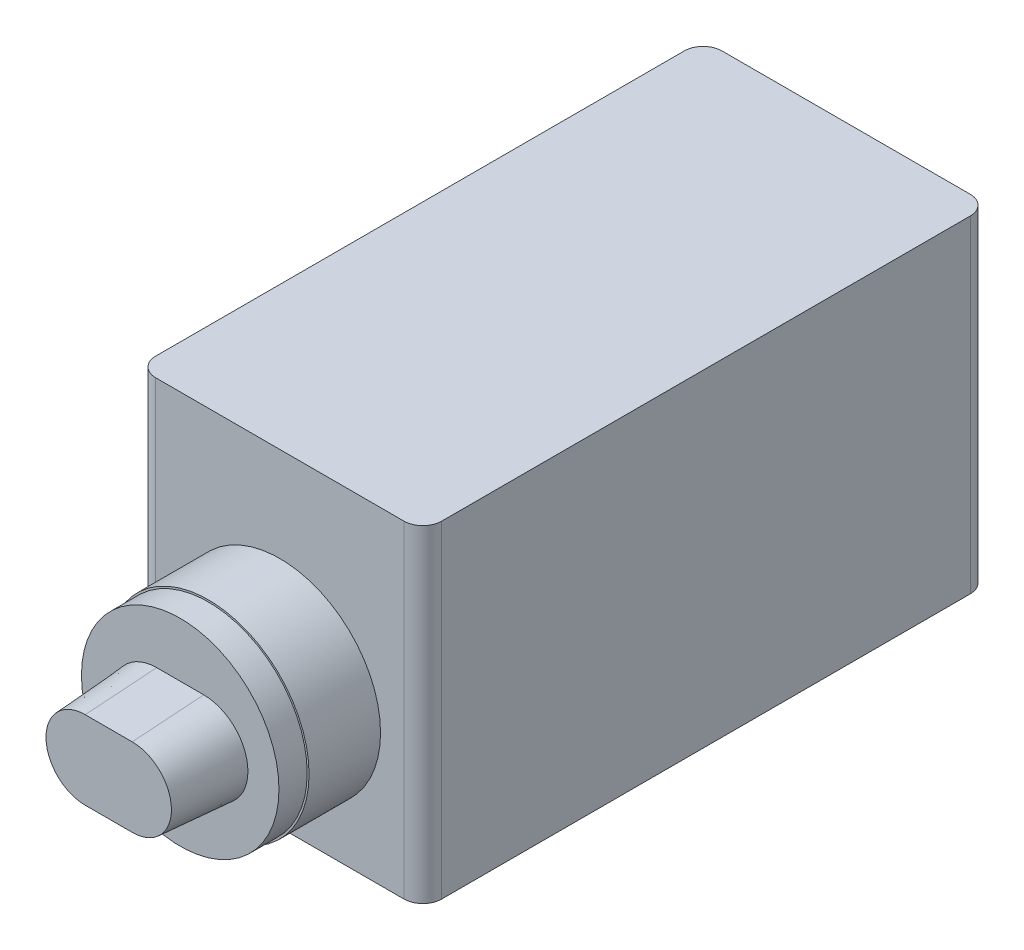
ISO-10303-21;
HEADER;
FILE_DESCRIPTION(('STEP AP214'),'2;1');
FILE_NAME('part.step','',(''),(''),'','','');
FILE_SCHEMA(('AUTOMOTIVE_DESIGN { 1 0 10303 214 1 1 1 1 }'));
ENDSEC;
DATA;
#1=APPLICATION_CONTEXT('core data for automotive mechanical design processes');
#2=APPLICATION_PROTOCOL_DEFINITION('international standard','automotive_design',2000,#1);
#3=PRODUCT_CONTEXT('',#1,'mechanical');
#4=PRODUCT('Part','Part','',(#3));
#5=PRODUCT_RELATED_PRODUCT_CATEGORY('part','',(#4));
#6=PRODUCT_DEFINITION_FORMATION('','',#4);
#7=PRODUCT_DEFINITION_CONTEXT('part definition',#1,'design');
#8=PRODUCT_DEFINITION('design','',#6,#7);
#9=PRODUCT_DEFINITION_SHAPE('','',#8);
#10=(LENGTH_UNIT() NAMED_UNIT(*) SI_UNIT(.MILLI.,.METRE.));
#11=(NAMED_UNIT(*) PLANE_ANGLE_UNIT() SI_UNIT($,.RADIAN.));
#12=(NAMED_UNIT(*) SI_UNIT($,.STERADIAN.) SOLID_ANGLE_UNIT());
#13=UNCERTAINTY_MEASURE_WITH_UNIT(LENGTH_MEASURE(1.E-05),#10,'distance_accuracy_value','');
#14=(GEOMETRIC_REPRESENTATION_CONTEXT(3) GLOBAL_UNCERTAINTY_ASSIGNED_CONTEXT((#13)) GLOBAL_UNIT_ASSIGNED_CONTEXT((#10,
#11,#12)) REPRESENTATION_CONTEXT('',''));
#15=CARTESIAN_POINT('',(0.,0.,0.));
#16=DIRECTION('',(0.,0.,1.));
#17=DIRECTION('',(1.,0.,0.));
#18=AXIS2_PLACEMENT_3D('',#15,#16,#17);
#19=CARTESIAN_POINT('',(0.,7.03074551830696,20.35));
#20=DIRECTION('',(0.,0.,1.));
#21=DIRECTION('',(1.,0.,0.));
#22=AXIS2_PLACEMENT_3D('',#19,#20,#21);
#23=PLANE('',#22);
#24=CARTESIAN_POINT('',(0.,7.03074551830696,20.35));
#25=DIRECTION('',(0.,0.,1.));
#26=DIRECTION('',(1.,0.,0.));
#27=AXIS2_PLACEMENT_3D('',#24,#25,#26);
#28=CIRCLE('',#27,5.25);
#29=CARTESIAN_POINT('',(5.25,7.03074551830696,20.35));
#30=VERTEX_POINT('',#29);
#31=EDGE_CURVE('E168',#30,#30,#28,.T.);
#32=ORIENTED_EDGE('',*,*,#31,.T.);
#33=EDGE_LOOP('',(#32));
#34=FACE_BOUND('',#33,.T.);
#35=DIRECTION('',(1.,0.,0.));
#36=VECTOR('',#35,1.);
#37=CARTESIAN_POINT('',(-1.25,4.68074551830696,20.35));
#38=LINE('',#37,#36);
#39=CARTESIAN_POINT('',(-1.25,4.68074551830696,20.35));
#40=VERTEX_POINT('',#39);
#41=CARTESIAN_POINT('',(1.25,4.68074551830696,20.35));
#42=VERTEX_POINT('',#41);
#43=EDGE_CURVE('E133',#40,#42,#38,.T.);
#44=ORIENTED_EDGE('',*,*,#43,.F.);
#45=CARTESIAN_POINT('',(-1.25,7.03074551830696,20.35));
#46=DIRECTION('',(0.,0.,1.));
#47=DIRECTION('',(1.,0.,0.));
#48=AXIS2_PLACEMENT_3D('',#45,#46,#47);
#49=CIRCLE('',#48,2.35);
#50=CARTESIAN_POINT('',(-1.25,9.38074551830696,20.35));
#51=VERTEX_POINT('',#50);
#52=EDGE_CURVE('E144',#51,#40,#49,.T.);
#53=ORIENTED_EDGE('',*,*,#52,.F.);
#54=DIRECTION('',(-1.,0.,0.));
#55=VECTOR('',#54,1.);
#56=CARTESIAN_POINT('',(-1.25,9.38074551830696,20.35));
#57=LINE('',#56,#55);
#58=CARTESIAN_POINT('',(1.25,9.38074551830696,20.35));
#59=VERTEX_POINT('',#58);
#60=EDGE_CURVE('E154',#59,#51,#57,.T.);
#61=ORIENTED_EDGE('',*,*,#60,.F.);
#62=CARTESIAN_POINT('',(1.25,7.03074551830696,20.35));
#63=DIRECTION('',(0.,0.,1.));
#64=DIRECTION('',(1.,0.,0.));
#65=AXIS2_PLACEMENT_3D('',#62,#63,#64);
#66=CIRCLE('',#65,2.35);
#67=EDGE_CURVE('E152',#42,#59,#66,.T.);
#68=ORIENTED_EDGE('',*,*,#67,.F.);
#69=EDGE_LOOP('',(#44,#53,#61,#68));
#70=FACE_BOUND('',#69,.T.);
#71=ADVANCED_FACE('F37',(#34,#70),#23,.T.);
#72=CARTESIAN_POINT('',(0.,7.03074551830696,18.85));
#73=DIRECTION('',(0.,0.,1.));
#74=DIRECTION('',(1.,0.,0.));
#75=AXIS2_PLACEMENT_3D('',#72,#73,#74);
#76=PLANE('',#75);
#77=CARTESIAN_POINT('',(0.,7.03074551830696,18.85));
#78=DIRECTION('',(0.,0.,1.));
#79=DIRECTION('',(1.,0.,0.));
#80=AXIS2_PLACEMENT_3D('',#77,#78,#79);
#81=CIRCLE('',#80,5.35);
#82=CARTESIAN_POINT('',(5.35,7.03074551830696,18.85));
#83=VERTEX_POINT('',#82);
#84=EDGE_CURVE('E171',#83,#83,#81,.T.);
#85=ORIENTED_EDGE('',*,*,#84,.T.);
#86=EDGE_LOOP('',(#85));
#87=FACE_BOUND('',#86,.T.);
#88=CARTESIAN_POINT('',(0.,7.03074551830696,18.85));
#89=DIRECTION('',(0.,0.,1.));
#90=DIRECTION('',(1.,0.,0.));
#91=AXIS2_PLACEMENT_3D('',#88,#89,#90);
#92=CIRCLE('',#91,5.25);
#93=CARTESIAN_POINT('',(5.25,7.03074551830696,18.85));
#94=VERTEX_POINT('',#93);
#95=EDGE_CURVE('E139',#94,#94,#92,.T.);
#96=ORIENTED_EDGE('',*,*,#95,.F.);
#97=EDGE_LOOP('',(#96));
#98=FACE_BOUND('',#97,.T.);
#99=ADVANCED_FACE('F275',(#87,#98),#76,.T.);
#100=CARTESIAN_POINT('',(7.6,17.4,15.05));
#101=DIRECTION('',(0.,0.,-1.));
#102=DIRECTION('',(-1.,0.,0.));
#103=AXIS2_PLACEMENT_3D('',#100,#101,#102);
#104=PLANE('',#103);
#105=DIRECTION('',(1.,0.,0.));
#106=VECTOR('',#105,1.);
#107=CARTESIAN_POINT('',(7.6,17.4,15.05));
#108=LINE('',#107,#106);
#109=CARTESIAN_POINT('',(-6.6,17.4,15.05));
#110=VERTEX_POINT('',#109);
#111=CARTESIAN_POINT('',(6.6,17.4,15.05));
#112=VERTEX_POINT('',#111);
#113=EDGE_CURVE('E180',#110,#112,#108,.T.);
#114=ORIENTED_EDGE('',*,*,#113,.F.);
#115=DIRECTION('',(0.,-1.,0.));
#116=VECTOR('',#115,1.);
#117=CARTESIAN_POINT('',(-6.6,17.4,15.05));
#118=LINE('',#117,#116);
#119=CARTESIAN_POINT('',(-6.6,0.,15.05));
#120=VERTEX_POINT('',#119);
#121=EDGE_CURVE('E45',#110,#120,#118,.T.);
#122=ORIENTED_EDGE('',*,*,#121,.T.);
#123=DIRECTION('',(1.,0.,0.));
#124=VECTOR('',#123,1.);
#125=CARTESIAN_POINT('',(7.6,0.,15.05));
#126=LINE('',#125,#124);
#127=CARTESIAN_POINT('',(6.6,0.,15.05));
#128=VERTEX_POINT('',#127);
#129=EDGE_CURVE('E192',#120,#128,#126,.T.);
#130=ORIENTED_EDGE('',*,*,#129,.T.);
#131=DIRECTION('',(0.,-1.,0.));
#132=VECTOR('',#131,1.);
#133=CARTESIAN_POINT('',(6.6,17.4,15.05));
#134=LINE('',#133,#132);
#135=EDGE_CURVE('E228',#128,#112,#134,.F.);
#136=ORIENTED_EDGE('',*,*,#135,.T.);
#137=EDGE_LOOP('',(#114,#122,#130,#136));
#138=FACE_BOUND('',#137,.T.);
#139=CARTESIAN_POINT('',(0.,7.03074551830696,15.05));
#140=DIRECTION('',(0.,0.,-1.));
#141=DIRECTION('',(-1.,0.,0.));
#142=AXIS2_PLACEMENT_3D('',#139,#140,#141);
#143=CIRCLE('',#142,5.35);
#144=CARTESIAN_POINT('',(-5.35,7.03074551830696,15.05));
#145=VERTEX_POINT('',#144);
#146=EDGE_CURVE('E11',#145,#145,#143,.F.);
#147=ORIENTED_EDGE('',*,*,#146,.F.);
#148=EDGE_LOOP('',(#147));
#149=FACE_BOUND('',#148,.T.);
#150=ADVANCED_FACE('F234',(#138,#149),#104,.F.);
#151=CARTESIAN_POINT('',(-7.6,17.4,15.05));
#152=DIRECTION('',(1.,0.,0.));
#153=DIRECTION('',(0.,0.,-1.));
#154=AXIS2_PLACEMENT_3D('',#151,#152,#153);
#155=PLANE('',#154);
#156=DIRECTION('',(0.,0.,1.));
#157=VECTOR('',#156,1.);
#158=CARTESIAN_POINT('',(-7.6,17.4,15.05));
#159=LINE('',#158,#157);
#160=CARTESIAN_POINT('',(-7.6,17.4,-14.05));
#161=VERTEX_POINT('',#160);
#162=CARTESIAN_POINT('',(-7.6,17.4,14.05));
#163=VERTEX_POINT('',#162);
#164=EDGE_CURVE('E177',#161,#163,#159,.T.);
#165=ORIENTED_EDGE('',*,*,#164,.F.);
#166=DIRECTION('',(0.,-1.,0.));
#167=VECTOR('',#166,1.);
#168=CARTESIAN_POINT('',(-7.6,17.4,-14.05));
#169=LINE('',#168,#167);
#170=CARTESIAN_POINT('',(-7.6,0.,-14.05));
#171=VERTEX_POINT('',#170);
#172=EDGE_CURVE('E200',#161,#171,#169,.T.);
#173=ORIENTED_EDGE('',*,*,#172,.T.);
#174=DIRECTION('',(0.,0.,1.));
#175=VECTOR('',#174,1.);
#176=CARTESIAN_POINT('',(-7.6,0.,15.05));
#177=LINE('',#176,#175);
#178=CARTESIAN_POINT('',(-7.6,0.,14.05));
#179=VERTEX_POINT('',#178);
#180=EDGE_CURVE('E176',#171,#179,#177,.T.);
#181=ORIENTED_EDGE('',*,*,#180,.T.);
#182=DIRECTION('',(0.,-1.,0.));
#183=VECTOR('',#182,1.);
#184=CARTESIAN_POINT('',(-7.6,17.4,14.05));
#185=LINE('',#184,#183);
#186=EDGE_CURVE('E189',#179,#163,#185,.F.);
#187=ORIENTED_EDGE('',*,*,#186,.T.);
#188=EDGE_LOOP('',(#165,#173,#181,#187));
#189=FACE_BOUND('',#188,.T.);
#190=ADVANCED_FACE('F264',(#189),#155,.F.);
#191=CARTESIAN_POINT('',(7.6,17.4,15.05));
#192=DIRECTION('',(-1.,0.,0.));
#193=DIRECTION('',(0.,0.,1.));
#194=AXIS2_PLACEMENT_3D('',#191,#192,#193);
#195=PLANE('',#194);
#196=DIRECTION('',(0.,0.,-1.));
#197=VECTOR('',#196,1.);
#198=CARTESIAN_POINT('',(7.6,0.,15.05));
#199=LINE('',#198,#197);
#200=CARTESIAN_POINT('',(7.6,0.,14.05));
#201=VERTEX_POINT('',#200);
#202=CARTESIAN_POINT('',(7.6,0.,-14.05));
#203=VERTEX_POINT('',#202);
#204=EDGE_CURVE('E195',#201,#203,#199,.T.);
#205=ORIENTED_EDGE('',*,*,#204,.T.);
#206=DIRECTION('',(0.,-1.,0.));
#207=VECTOR('',#206,1.);
#208=CARTESIAN_POINT('',(7.6,17.4,-14.05));
#209=LINE('',#208,#207);
#210=CARTESIAN_POINT('',(7.6,17.4,-14.05));
#211=VERTEX_POINT('',#210);
#212=EDGE_CURVE('E60',#203,#211,#209,.F.);
#213=ORIENTED_EDGE('',*,*,#212,.T.);
#214=DIRECTION('',(0.,0.,-1.));
#215=VECTOR('',#214,1.);
#216=CARTESIAN_POINT('',(7.6,17.4,15.05));
#217=LINE('',#216,#215);
#218=CARTESIAN_POINT('',(7.6,17.4,14.05));
#219=VERTEX_POINT('',#218);
#220=EDGE_CURVE('E184',#219,#211,#217,.T.);
#221=ORIENTED_EDGE('',*,*,#220,.F.);
#222=DIRECTION('',(0.,-1.,0.));
#223=VECTOR('',#222,1.);
#224=CARTESIAN_POINT('',(7.6,17.4,14.05));
#225=LINE('',#224,#223);
#226=EDGE_CURVE('E224',#219,#201,#225,.T.);
#227=ORIENTED_EDGE('',*,*,#226,.T.);
#228=EDGE_LOOP('',(#205,#213,#221,#227));
#229=FACE_BOUND('',#228,.T.);
#230=ADVANCED_FACE('F246',(#229),#195,.F.);
#231=CARTESIAN_POINT('',(7.6,17.4,-15.05));
#232=DIRECTION('',(0.,0.,1.));
#233=DIRECTION('',(1.,0.,0.));
#234=AXIS2_PLACEMENT_3D('',#231,#232,#233);
#235=PLANE('',#234);
#236=DIRECTION('',(-1.,0.,0.));
#237=VECTOR('',#236,1.);
#238=CARTESIAN_POINT('',(7.6,0.,-15.05));
#239=LINE('',#238,#237);
#240=CARTESIAN_POINT('',(6.6,0.,-15.05));
#241=VERTEX_POINT('',#240);
#242=CARTESIAN_POINT('',(-6.6,0.,-15.05));
#243=VERTEX_POINT('',#242);
#244=EDGE_CURVE('E181',#241,#243,#239,.T.);
#245=ORIENTED_EDGE('',*,*,#244,.T.);
#246=DIRECTION('',(0.,-1.,0.));
#247=VECTOR('',#246,1.);
#248=CARTESIAN_POINT('',(-6.6,17.4,-15.05));
#249=LINE('',#248,#247);
#250=CARTESIAN_POINT('',(-6.6,17.4,-15.05));
#251=VERTEX_POINT('',#250);
#252=EDGE_CURVE('E214',#243,#251,#249,.F.);
#253=ORIENTED_EDGE('',*,*,#252,.T.);
#254=DIRECTION('',(-1.,0.,0.));
#255=VECTOR('',#254,1.);
#256=CARTESIAN_POINT('',(7.6,17.4,-15.05));
#257=LINE('',#256,#255);
#258=CARTESIAN_POINT('',(6.6,17.4,-15.05));
#259=VERTEX_POINT('',#258);
#260=EDGE_CURVE('E186',#259,#251,#257,.T.);
#261=ORIENTED_EDGE('',*,*,#260,.F.);
#262=DIRECTION('',(0.,-1.,0.));
#263=VECTOR('',#262,1.);
#264=CARTESIAN_POINT('',(6.6,17.4,-15.05));
#265=LINE('',#264,#263);
#266=EDGE_CURVE('E211',#259,#241,#265,.T.);
#267=ORIENTED_EDGE('',*,*,#266,.T.);
#268=EDGE_LOOP('',(#245,#253,#261,#267));
#269=FACE_BOUND('',#268,.T.);
#270=ADVANCED_FACE('F256',(#269),#235,.F.);
#271=CARTESIAN_POINT('',(-7.6,17.4,-15.05));
#272=DIRECTION('',(0.,1.,0.));
#273=DIRECTION('',(0.,0.,1.));
#274=AXIS2_PLACEMENT_3D('',#271,#272,#273);
#275=PLANE('',#274);
#276=ORIENTED_EDGE('',*,*,#260,.T.);
#277=CARTESIAN_POINT('',(-6.6,17.4,-14.05));
#278=DIRECTION('',(0.,1.,0.));
#279=DIRECTION('',(0.,0.,1.));
#280=AXIS2_PLACEMENT_3D('',#277,#278,#279);
#281=CIRCLE('',#280,1.);
#282=EDGE_CURVE('E222',#251,#161,#281,.T.);
#283=ORIENTED_EDGE('',*,*,#282,.T.);
#284=ORIENTED_EDGE('',*,*,#164,.T.);
#285=CARTESIAN_POINT('',(-6.6,17.4,14.05));
#286=DIRECTION('',(0.,1.,0.));
#287=DIRECTION('',(0.,0.,1.));
#288=AXIS2_PLACEMENT_3D('',#285,#286,#287);
#289=CIRCLE('',#288,1.);
#290=EDGE_CURVE('E218',#163,#110,#289,.T.);
#291=ORIENTED_EDGE('',*,*,#290,.T.);
#292=ORIENTED_EDGE('',*,*,#113,.T.);
#293=CARTESIAN_POINT('',(6.6,17.4,14.05));
#294=DIRECTION('',(0.,1.,0.));
#295=DIRECTION('',(0.,0.,1.));
#296=AXIS2_PLACEMENT_3D('',#293,#294,#295);
#297=CIRCLE('',#296,1.);
#298=EDGE_CURVE('E216',#112,#219,#297,.T.);
#299=ORIENTED_EDGE('',*,*,#298,.T.);
#300=ORIENTED_EDGE('',*,*,#220,.T.);
#301=CARTESIAN_POINT('',(6.6,17.4,-14.05));
#302=DIRECTION('',(0.,1.,0.));
#303=DIRECTION('',(0.,0.,1.));
#304=AXIS2_PLACEMENT_3D('',#301,#302,#303);
#305=CIRCLE('',#304,1.);
#306=EDGE_CURVE('E220',#211,#259,#305,.T.);
#307=ORIENTED_EDGE('',*,*,#306,.T.);
#308=EDGE_LOOP('',(#276,#283,#284,#291,#292,#299,#300,#307));
#309=FACE_BOUND('',#308,.T.);
#310=ADVANCED_FACE('F249',(#309),#275,.T.);
#311=CARTESIAN_POINT('',(-7.6,0.,-15.05));
#312=DIRECTION('',(0.,1.,0.));
#313=DIRECTION('',(0.,0.,1.));
#314=AXIS2_PLACEMENT_3D('',#311,#312,#313);
#315=PLANE('',#314);
#316=ORIENTED_EDGE('',*,*,#180,.F.);
#317=CARTESIAN_POINT('',(-6.6,0.,-14.05));
#318=DIRECTION('',(0.,1.,0.));
#319=DIRECTION('',(0.,0.,1.));
#320=AXIS2_PLACEMENT_3D('',#317,#318,#319);
#321=CIRCLE('',#320,1.);
#322=EDGE_CURVE('E209',#171,#243,#321,.F.);
#323=ORIENTED_EDGE('',*,*,#322,.T.);
#324=ORIENTED_EDGE('',*,*,#244,.F.);
#325=CARTESIAN_POINT('',(6.6,0.,-14.05));
#326=DIRECTION('',(0.,1.,0.));
#327=DIRECTION('',(0.,0.,1.));
#328=AXIS2_PLACEMENT_3D('',#325,#326,#327);
#329=CIRCLE('',#328,1.);
#330=EDGE_CURVE('E207',#241,#203,#329,.F.);
#331=ORIENTED_EDGE('',*,*,#330,.T.);
#332=ORIENTED_EDGE('',*,*,#204,.F.);
#333=CARTESIAN_POINT('',(6.6,0.,14.05));
#334=DIRECTION('',(0.,1.,0.));
#335=DIRECTION('',(0.,0.,1.));
#336=AXIS2_PLACEMENT_3D('',#333,#334,#335);
#337=CIRCLE('',#336,1.);
#338=EDGE_CURVE('E203',#201,#128,#337,.F.);
#339=ORIENTED_EDGE('',*,*,#338,.T.);
#340=ORIENTED_EDGE('',*,*,#129,.F.);
#341=CARTESIAN_POINT('',(-6.6,0.,14.05));
#342=DIRECTION('',(0.,1.,0.));
#343=DIRECTION('',(0.,0.,1.));
#344=AXIS2_PLACEMENT_3D('',#341,#342,#343);
#345=CIRCLE('',#344,1.);
#346=EDGE_CURVE('E205',#120,#179,#345,.F.);
#347=ORIENTED_EDGE('',*,*,#346,.T.);
#348=EDGE_LOOP('',(#316,#323,#324,#331,#332,#339,#340,#347));
#349=FACE_BOUND('',#348,.T.);
#350=ADVANCED_FACE('F241',(#349),#315,.F.);
#351=CARTESIAN_POINT('',(-6.6,17.4,-14.05));
#352=DIRECTION('',(0.,-1.,0.));
#353=DIRECTION('',(0.,0.,-1.));
#354=AXIS2_PLACEMENT_3D('',#351,#352,#353);
#355=CYLINDRICAL_SURFACE('',#354,1.);
#356=ORIENTED_EDGE('',*,*,#282,.F.);
#357=ORIENTED_EDGE('',*,*,#252,.F.);
#358=ORIENTED_EDGE('',*,*,#322,.F.);
#359=ORIENTED_EDGE('',*,*,#172,.F.);
#360=EDGE_LOOP('',(#356,#357,#358,#359));
#361=FACE_BOUND('',#360,.T.);
#362=ADVANCED_FACE('F261',(#361),#355,.T.);
#363=CARTESIAN_POINT('',(6.6,17.4,-14.05));
#364=DIRECTION('',(0.,-1.,0.));
#365=DIRECTION('',(0.,0.,-1.));
#366=AXIS2_PLACEMENT_3D('',#363,#364,#365);
#367=CYLINDRICAL_SURFACE('',#366,1.);
#368=ORIENTED_EDGE('',*,*,#306,.F.);
#369=ORIENTED_EDGE('',*,*,#212,.F.);
#370=ORIENTED_EDGE('',*,*,#330,.F.);
#371=ORIENTED_EDGE('',*,*,#266,.F.);
#372=EDGE_LOOP('',(#368,#369,#370,#371));
#373=FACE_BOUND('',#372,.T.);
#374=ADVANCED_FACE('F253',(#373),#367,.T.);
#375=CARTESIAN_POINT('',(-6.6,17.4,14.05));
#376=DIRECTION('',(0.,-1.,0.));
#377=DIRECTION('',(0.,0.,-1.));
#378=AXIS2_PLACEMENT_3D('',#375,#376,#377);
#379=CYLINDRICAL_SURFACE('',#378,1.);
#380=ORIENTED_EDGE('',*,*,#290,.F.);
#381=ORIENTED_EDGE('',*,*,#186,.F.);
#382=ORIENTED_EDGE('',*,*,#346,.F.);
#383=ORIENTED_EDGE('',*,*,#121,.F.);
#384=EDGE_LOOP('',(#380,#381,#382,#383));
#385=FACE_BOUND('',#384,.T.);
#386=ADVANCED_FACE('F266',(#385),#379,.T.);
#387=CARTESIAN_POINT('',(6.6,17.4,14.05));
#388=DIRECTION('',(0.,-1.,0.));
#389=DIRECTION('',(0.,0.,-1.));
#390=AXIS2_PLACEMENT_3D('',#387,#388,#389);
#391=CYLINDRICAL_SURFACE('',#390,1.);
#392=ORIENTED_EDGE('',*,*,#298,.F.);
#393=ORIENTED_EDGE('',*,*,#135,.F.);
#394=ORIENTED_EDGE('',*,*,#338,.F.);
#395=ORIENTED_EDGE('',*,*,#226,.F.);
#396=EDGE_LOOP('',(#392,#393,#394,#395));
#397=FACE_BOUND('',#396,.T.);
#398=ADVANCED_FACE('F39',(#397),#391,.T.);
#399=CARTESIAN_POINT('',(0.,7.03074551830696,18.85));
#400=DIRECTION('',(0.,0.,-1.));
#401=DIRECTION('',(-1.,0.,0.));
#402=AXIS2_PLACEMENT_3D('',#399,#400,#401);
#403=CYLINDRICAL_SURFACE('',#402,5.35);
#404=ORIENTED_EDGE('',*,*,#84,.F.);
#405=EDGE_LOOP('',(#404));
#406=FACE_BOUND('',#405,.T.);
#407=ORIENTED_EDGE('',*,*,#146,.T.);
#408=EDGE_LOOP('',(#407));
#409=FACE_BOUND('',#408,.T.);
#410=ADVANCED_FACE('F272',(#406,#409),#403,.T.);
#411=CARTESIAN_POINT('',(0.,7.03074551830696,20.35));
#412=DIRECTION('',(0.,0.,-1.));
#413=DIRECTION('',(-1.,0.,0.));
#414=AXIS2_PLACEMENT_3D('',#411,#412,#413);
#415=CYLINDRICAL_SURFACE('',#414,5.25);
#416=ORIENTED_EDGE('',*,*,#31,.F.);
#417=EDGE_LOOP('',(#416));
#418=FACE_BOUND('',#417,.T.);
#419=ORIENTED_EDGE('',*,*,#95,.T.);
#420=EDGE_LOOP('',(#419));
#421=FACE_BOUND('',#420,.T.);
#422=ADVANCED_FACE('F287',(#418,#421),#415,.T.);
#423=CARTESIAN_POINT('',(-1.25,7.03074551830696,20.35));
#424=DIRECTION('',(0.,0.,-1.));
#425=DIRECTION('',(1.,0.,0.));
#426=AXIS2_PLACEMENT_3D('',#423,#424,#425);
#427=CONICAL_SURFACE('',#426,2.35,0.0698131700797733);
#428=ORIENTED_EDGE('',*,*,#52,.T.);
#429=DIRECTION('',(0.,-0.0697564737441255,-0.997564050259824));
#430=VECTOR('',#429,1.);
#431=CARTESIAN_POINT('',(-1.25,4.68074551830696,20.35));
#432=LINE('',#431,#430);
#433=CARTESIAN_POINT('',(-1.25,4.9464674036923,24.15));
#434=VERTEX_POINT('',#433);
#435=EDGE_CURVE('E128',#434,#40,#432,.T.);
#436=ORIENTED_EDGE('',*,*,#435,.F.);
#437=CARTESIAN_POINT('',(-1.25,7.03074551830696,24.15));
#438=DIRECTION('',(0.,0.,1.));
#439=DIRECTION('',(1.,0.,0.));
#440=AXIS2_PLACEMENT_3D('',#437,#438,#439);
#441=CIRCLE('',#440,2.08427811461466);
#442=CARTESIAN_POINT('',(-1.25,9.11502363292162,24.15));
#443=VERTEX_POINT('',#442);
#444=EDGE_CURVE('E157',#443,#434,#441,.T.);
#445=ORIENTED_EDGE('',*,*,#444,.F.);
#446=DIRECTION('',(0.,0.0697564737441255,-0.997564050259824));
#447=VECTOR('',#446,1.);
#448=CARTESIAN_POINT('',(-1.25,9.38074551830696,20.35));
#449=LINE('',#448,#447);
#450=EDGE_CURVE('E147',#443,#51,#449,.T.);
#451=ORIENTED_EDGE('',*,*,#450,.T.);
#452=EDGE_LOOP('',(#428,#436,#445,#451));
#453=FACE_BOUND('',#452,.T.);
#454=ADVANCED_FACE('F145',(#453),#427,.T.);
#455=CARTESIAN_POINT('',(-1.25,4.68074551830696,20.35));
#456=DIRECTION('',(0.,-0.997564050259824,0.0697564737441255));
#457=DIRECTION('',(0.,-0.0697564737441255,-0.997564050259824));
#458=AXIS2_PLACEMENT_3D('',#455,#456,#457);
#459=PLANE('',#458);
#460=ORIENTED_EDGE('',*,*,#43,.T.);
#461=DIRECTION('',(0.,-0.0697564737441255,-0.997564050259824));
#462=VECTOR('',#461,1.);
#463=CARTESIAN_POINT('',(1.25,4.68074551830696,20.35));
#464=LINE('',#463,#462);
#465=CARTESIAN_POINT('',(1.25,4.9464674036923,24.15));
#466=VERTEX_POINT('',#465);
#467=EDGE_CURVE('E140',#466,#42,#464,.T.);
#468=ORIENTED_EDGE('',*,*,#467,.F.);
#469=DIRECTION('',(-1.,0.,0.));
#470=VECTOR('',#469,1.);
#471=CARTESIAN_POINT('',(-1.25,4.9464674036923,24.15));
#472=LINE('',#471,#470);
#473=EDGE_CURVE('E135',#434,#466,#472,.F.);
#474=ORIENTED_EDGE('',*,*,#473,.F.);
#475=ORIENTED_EDGE('',*,*,#435,.T.);
#476=EDGE_LOOP('',(#460,#468,#474,#475));
#477=FACE_BOUND('',#476,.T.);
#478=ADVANCED_FACE('F130',(#477),#459,.T.);
#479=CARTESIAN_POINT('',(1.25,7.03074551830696,20.35));
#480=DIRECTION('',(0.,0.,-1.));
#481=DIRECTION('',(1.,0.,0.));
#482=AXIS2_PLACEMENT_3D('',#479,#480,#481);
#483=CONICAL_SURFACE('',#482,2.35,0.0698131700797733);
#484=ORIENTED_EDGE('',*,*,#67,.T.);
#485=DIRECTION('',(0.,0.0697564737441255,-0.997564050259824));
#486=VECTOR('',#485,1.);
#487=CARTESIAN_POINT('',(1.25,9.38074551830696,20.35));
#488=LINE('',#487,#486);
#489=CARTESIAN_POINT('',(1.25,9.11502363292162,24.15));
#490=VERTEX_POINT('',#489);
#491=EDGE_CURVE('E52',#490,#59,#488,.T.);
#492=ORIENTED_EDGE('',*,*,#491,.F.);
#493=CARTESIAN_POINT('',(1.25,7.03074551830696,24.15));
#494=DIRECTION('',(0.,0.,1.));
#495=DIRECTION('',(1.,0.,0.));
#496=AXIS2_PLACEMENT_3D('',#493,#494,#495);
#497=CIRCLE('',#496,2.08427811461466);
#498=EDGE_CURVE('E165',#466,#490,#497,.T.);
#499=ORIENTED_EDGE('',*,*,#498,.F.);
#500=ORIENTED_EDGE('',*,*,#467,.T.);
#501=EDGE_LOOP('',(#484,#492,#499,#500));
#502=FACE_BOUND('',#501,.T.);
#503=ADVANCED_FACE('F368',(#502),#483,.T.);
#504=CARTESIAN_POINT('',(-1.25,9.38074551830696,20.35));
#505=DIRECTION('',(0.,0.997564050259824,0.0697564737441255));
#506=DIRECTION('',(0.,-0.0697564737441255,0.997564050259824));
#507=AXIS2_PLACEMENT_3D('',#504,#505,#506);
#508=PLANE('',#507);
#509=ORIENTED_EDGE('',*,*,#60,.T.);
#510=ORIENTED_EDGE('',*,*,#450,.F.);
#511=DIRECTION('',(1.,0.,0.));
#512=VECTOR('',#511,1.);
#513=CARTESIAN_POINT('',(-1.25,9.11502363292162,24.15));
#514=LINE('',#513,#512);
#515=EDGE_CURVE('E160',#490,#443,#514,.F.);
#516=ORIENTED_EDGE('',*,*,#515,.F.);
#517=ORIENTED_EDGE('',*,*,#491,.T.);
#518=EDGE_LOOP('',(#509,#510,#516,#517));
#519=FACE_BOUND('',#518,.T.);
#520=ADVANCED_FACE('F376',(#519),#508,.T.);
#521=CARTESIAN_POINT('',(-1.25,7.03074551830696,24.15));
#522=DIRECTION('',(0.,0.,1.));
#523=DIRECTION('',(1.,0.,0.));
#524=AXIS2_PLACEMENT_3D('',#521,#522,#523);
#525=PLANE('',#524);
#526=ORIENTED_EDGE('',*,*,#444,.T.);
#527=ORIENTED_EDGE('',*,*,#473,.T.);
#528=ORIENTED_EDGE('',*,*,#498,.T.);
#529=ORIENTED_EDGE('',*,*,#515,.T.);
#530=EDGE_LOOP('',(#526,#527,#528,#529));
#531=FACE_BOUND('',#530,.T.);
#532=ADVANCED_FACE('F385',(#531),#525,.T.);
#533=CLOSED_SHELL('',(#71,#99,#150,#190,#230,#270,#310,#350,#362,#374,#386,#398,#410,#422,#454,
#478,#503,#520,#532));
#534=MANIFOLD_SOLID_BREP('B2',#533);
#535=ADVANCED_BREP_SHAPE_REPRESENTATION('',(#18,#534),#14);
#536=SHAPE_DEFINITION_REPRESENTATION(#9,#535);
ENDSEC;
END-ISO-10303-21;
